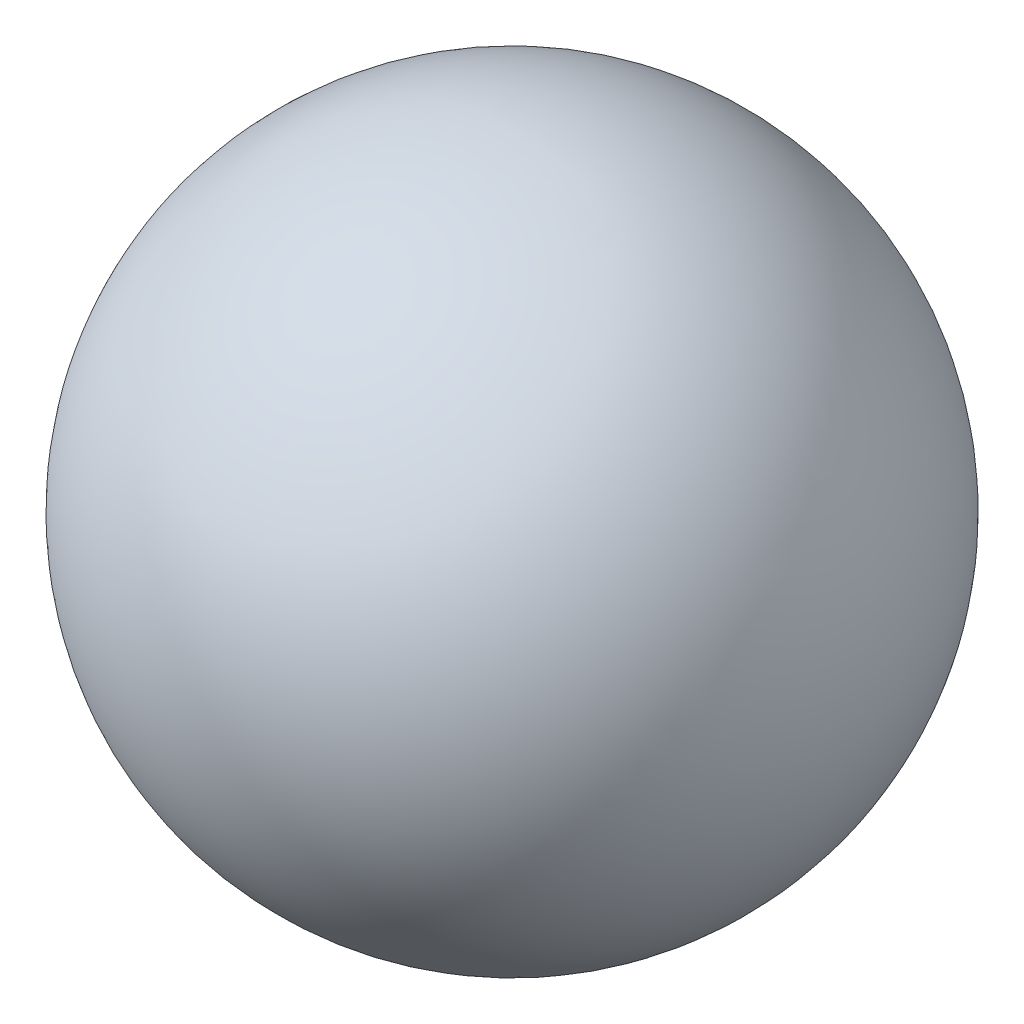
ISO-10303-21;
HEADER;
FILE_DESCRIPTION(('STEP AP214'),'2;1');
FILE_NAME('part.step','',(''),(''),'','','');
FILE_SCHEMA(('AUTOMOTIVE_DESIGN { 1 0 10303 214 1 1 1 1 }'));
ENDSEC;
DATA;
#1=APPLICATION_CONTEXT('core data for automotive mechanical design processes');
#2=APPLICATION_PROTOCOL_DEFINITION('international standard','automotive_design',2000,#1);
#3=PRODUCT_CONTEXT('',#1,'mechanical');
#4=PRODUCT('Part','Part','',(#3));
#5=PRODUCT_RELATED_PRODUCT_CATEGORY('part','',(#4));
#6=PRODUCT_DEFINITION_FORMATION('','',#4);
#7=PRODUCT_DEFINITION_CONTEXT('part definition',#1,'design');
#8=PRODUCT_DEFINITION('design','',#6,#7);
#9=PRODUCT_DEFINITION_SHAPE('','',#8);
#10=(LENGTH_UNIT() NAMED_UNIT(*) SI_UNIT(.MILLI.,.METRE.));
#11=(NAMED_UNIT(*) PLANE_ANGLE_UNIT() SI_UNIT($,.RADIAN.));
#12=(NAMED_UNIT(*) SI_UNIT($,.STERADIAN.) SOLID_ANGLE_UNIT());
#13=UNCERTAINTY_MEASURE_WITH_UNIT(LENGTH_MEASURE(1.E-05),#10,'distance_accuracy_value','');
#14=(GEOMETRIC_REPRESENTATION_CONTEXT(3) GLOBAL_UNCERTAINTY_ASSIGNED_CONTEXT((#13)) GLOBAL_UNIT_ASSIGNED_CONTEXT((#10,
#11,#12)) REPRESENTATION_CONTEXT('',''));
#15=CARTESIAN_POINT('',(0.,0.,0.));
#16=DIRECTION('',(0.,0.,1.));
#17=DIRECTION('',(1.,0.,0.));
#18=AXIS2_PLACEMENT_3D('',#15,#16,#17);
#19=CARTESIAN_POINT('',(-6.06520907209303,-8.34804411070645,0.));
#20=DIRECTION('',(1.,0.,0.));
#21=DIRECTION('',(0.,1.,0.));
#22=AXIS2_PLACEMENT_3D('',#19,#20,#21);
#23=SPHERICAL_SURFACE('',#22,1.71627890103155);
#24=CARTESIAN_POINT('',(-4.34893017106148,-8.34804411070645,0.));
#25=VERTEX_POINT('',#24);
#26=VERTEX_LOOP('',#25);
#27=FACE_BOUND('',#26,.T.);
#28=CARTESIAN_POINT('',(-7.78148797312458,-8.34804411070645,0.));
#29=VERTEX_POINT('',#28);
#30=VERTEX_LOOP('',#29);
#31=FACE_BOUND('',#30,.T.);
#32=ADVANCED_FACE('F16',(#27,#31),#23,.T.);
#33=CLOSED_SHELL('',(#32));
#34=MANIFOLD_SOLID_BREP('B1',#33);
#35=ADVANCED_BREP_SHAPE_REPRESENTATION('',(#18,#34),#14);
#36=SHAPE_DEFINITION_REPRESENTATION(#9,#35);
ENDSEC;
END-ISO-10303-21;
